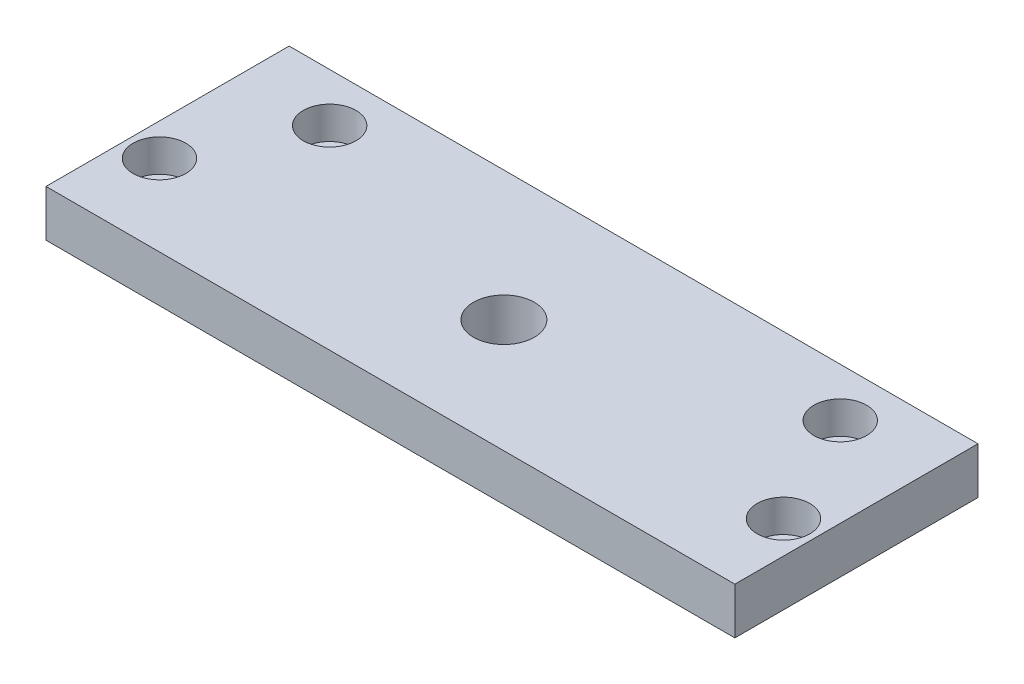
ISO-10303-21;
HEADER;
FILE_DESCRIPTION(('STEP AP214'),'2;1');
FILE_NAME('part.step','',(''),(''),'','','');
FILE_SCHEMA(('AUTOMOTIVE_DESIGN { 1 0 10303 214 1 1 1 1 }'));
ENDSEC;
DATA;
#1=APPLICATION_CONTEXT('core data for automotive mechanical design processes');
#2=APPLICATION_PROTOCOL_DEFINITION('international standard','automotive_design',2000,#1);
#3=PRODUCT_CONTEXT('',#1,'mechanical');
#4=PRODUCT('Part','Part','',(#3));
#5=PRODUCT_RELATED_PRODUCT_CATEGORY('part','',(#4));
#6=PRODUCT_DEFINITION_FORMATION('','',#4);
#7=PRODUCT_DEFINITION_CONTEXT('part definition',#1,'design');
#8=PRODUCT_DEFINITION('design','',#6,#7);
#9=PRODUCT_DEFINITION_SHAPE('','',#8);
#10=(LENGTH_UNIT() NAMED_UNIT(*) SI_UNIT(.MILLI.,.METRE.));
#11=(NAMED_UNIT(*) PLANE_ANGLE_UNIT() SI_UNIT($,.RADIAN.));
#12=(NAMED_UNIT(*) SI_UNIT($,.STERADIAN.) SOLID_ANGLE_UNIT());
#13=UNCERTAINTY_MEASURE_WITH_UNIT(LENGTH_MEASURE(1.E-05),#10,'distance_accuracy_value','');
#14=(GEOMETRIC_REPRESENTATION_CONTEXT(3) GLOBAL_UNCERTAINTY_ASSIGNED_CONTEXT((#13)) GLOBAL_UNIT_ASSIGNED_CONTEXT((#10,
#11,#12)) REPRESENTATION_CONTEXT('',''));
#15=CARTESIAN_POINT('',(0.,0.,0.));
#16=DIRECTION('',(0.,0.,1.));
#17=DIRECTION('',(1.,0.,0.));
#18=AXIS2_PLACEMENT_3D('',#15,#16,#17);
#19=CARTESIAN_POINT('',(-63.,3.5,-20.));
#20=DIRECTION('',(0.,1.,0.));
#21=DIRECTION('',(0.,0.,1.));
#22=AXIS2_PLACEMENT_3D('',#19,#20,#21);
#23=CYLINDRICAL_SURFACE('',#22,6.5);
#24=CARTESIAN_POINT('',(-63.,3.5,-20.));
#25=DIRECTION('',(0.,1.,0.));
#26=DIRECTION('',(0.,0.,1.));
#27=AXIS2_PLACEMENT_3D('',#24,#25,#26);
#28=CIRCLE('',#27,6.5);
#29=CARTESIAN_POINT('',(-63.,3.5,-13.5));
#30=VERTEX_POINT('',#29);
#31=EDGE_CURVE('E130',#30,#30,#28,.T.);
#32=ORIENTED_EDGE('',*,*,#31,.F.);
#33=EDGE_LOOP('',(#32));
#34=FACE_BOUND('',#33,.T.);
#35=CARTESIAN_POINT('',(-63.,11.5,-20.));
#36=DIRECTION('',(0.,1.,0.));
#37=DIRECTION('',(0.,0.,1.));
#38=AXIS2_PLACEMENT_3D('',#35,#36,#37);
#39=CIRCLE('',#38,6.5);
#40=CARTESIAN_POINT('',(-63.,11.5,-13.5));
#41=VERTEX_POINT('',#40);
#42=EDGE_CURVE('E124',#41,#41,#39,.T.);
#43=ORIENTED_EDGE('',*,*,#42,.T.);
#44=EDGE_LOOP('',(#43));
#45=FACE_BOUND('',#44,.T.);
#46=ADVANCED_FACE('F17',(#34,#45),#23,.F.);
#47=CARTESIAN_POINT('',(-77.,3.5,8.));
#48=DIRECTION('',(0.,1.,0.));
#49=DIRECTION('',(0.,0.,1.));
#50=AXIS2_PLACEMENT_3D('',#47,#48,#49);
#51=CYLINDRICAL_SURFACE('',#50,6.5);
#52=CARTESIAN_POINT('',(-77.,3.5,8.));
#53=DIRECTION('',(0.,1.,0.));
#54=DIRECTION('',(0.,0.,1.));
#55=AXIS2_PLACEMENT_3D('',#52,#53,#54);
#56=CIRCLE('',#55,6.5);
#57=CARTESIAN_POINT('',(-77.,3.5,14.5));
#58=VERTEX_POINT('',#57);
#59=EDGE_CURVE('E132',#58,#58,#56,.T.);
#60=ORIENTED_EDGE('',*,*,#59,.F.);
#61=EDGE_LOOP('',(#60));
#62=FACE_BOUND('',#61,.T.);
#63=CARTESIAN_POINT('',(-77.,11.5,8.));
#64=DIRECTION('',(0.,1.,0.));
#65=DIRECTION('',(0.,0.,1.));
#66=AXIS2_PLACEMENT_3D('',#63,#64,#65);
#67=CIRCLE('',#66,6.5);
#68=CARTESIAN_POINT('',(-77.,11.5,14.5));
#69=VERTEX_POINT('',#68);
#70=EDGE_CURVE('E121',#69,#69,#67,.T.);
#71=ORIENTED_EDGE('',*,*,#70,.T.);
#72=EDGE_LOOP('',(#71));
#73=FACE_BOUND('',#72,.T.);
#74=ADVANCED_FACE('F203',(#62,#73),#51,.F.);
#75=CARTESIAN_POINT('',(63.,3.5,-20.));
#76=DIRECTION('',(0.,1.,0.));
#77=DIRECTION('',(0.,0.,1.));
#78=AXIS2_PLACEMENT_3D('',#75,#76,#77);
#79=CYLINDRICAL_SURFACE('',#78,6.5);
#80=CARTESIAN_POINT('',(63.,3.5,-20.));
#81=DIRECTION('',(0.,1.,0.));
#82=DIRECTION('',(0.,0.,1.));
#83=AXIS2_PLACEMENT_3D('',#80,#81,#82);
#84=CIRCLE('',#83,6.5);
#85=CARTESIAN_POINT('',(63.,3.5,-13.5));
#86=VERTEX_POINT('',#85);
#87=EDGE_CURVE('E127',#86,#86,#84,.T.);
#88=ORIENTED_EDGE('',*,*,#87,.F.);
#89=EDGE_LOOP('',(#88));
#90=FACE_BOUND('',#89,.T.);
#91=CARTESIAN_POINT('',(63.,11.5,-20.));
#92=DIRECTION('',(0.,1.,0.));
#93=DIRECTION('',(0.,0.,1.));
#94=AXIS2_PLACEMENT_3D('',#91,#92,#93);
#95=CIRCLE('',#94,6.5);
#96=CARTESIAN_POINT('',(63.,11.5,-13.5));
#97=VERTEX_POINT('',#96);
#98=EDGE_CURVE('E118',#97,#97,#95,.T.);
#99=ORIENTED_EDGE('',*,*,#98,.T.);
#100=EDGE_LOOP('',(#99));
#101=FACE_BOUND('',#100,.T.);
#102=ADVANCED_FACE('F145',(#90,#101),#79,.F.);
#103=CARTESIAN_POINT('',(77.,3.5,8.));
#104=DIRECTION('',(0.,1.,0.));
#105=DIRECTION('',(0.,0.,1.));
#106=AXIS2_PLACEMENT_3D('',#103,#104,#105);
#107=CYLINDRICAL_SURFACE('',#106,6.5);
#108=CARTESIAN_POINT('',(77.,3.5,8.));
#109=DIRECTION('',(0.,1.,0.));
#110=DIRECTION('',(0.,0.,1.));
#111=AXIS2_PLACEMENT_3D('',#108,#109,#110);
#112=CIRCLE('',#111,6.5);
#113=CARTESIAN_POINT('',(77.,3.5,14.5));
#114=VERTEX_POINT('',#113);
#115=EDGE_CURVE('E20',#114,#114,#112,.T.);
#116=ORIENTED_EDGE('',*,*,#115,.F.);
#117=EDGE_LOOP('',(#116));
#118=FACE_BOUND('',#117,.T.);
#119=CARTESIAN_POINT('',(77.,11.5,8.));
#120=DIRECTION('',(0.,1.,0.));
#121=DIRECTION('',(0.,0.,1.));
#122=AXIS2_PLACEMENT_3D('',#119,#120,#121);
#123=CIRCLE('',#122,6.5);
#124=CARTESIAN_POINT('',(77.,11.5,14.5));
#125=VERTEX_POINT('',#124);
#126=EDGE_CURVE('E115',#125,#125,#123,.T.);
#127=ORIENTED_EDGE('',*,*,#126,.T.);
#128=EDGE_LOOP('',(#127));
#129=FACE_BOUND('',#128,.T.);
#130=ADVANCED_FACE('F142',(#118,#129),#107,.F.);
#131=CARTESIAN_POINT('',(77.,3.5,8.));
#132=DIRECTION('',(0.,1.,0.));
#133=DIRECTION('',(0.,0.,1.));
#134=AXIS2_PLACEMENT_3D('',#131,#132,#133);
#135=PLANE('',#134);
#136=ORIENTED_EDGE('',*,*,#115,.T.);
#137=EDGE_LOOP('',(#136));
#138=FACE_BOUND('',#137,.T.);
#139=CARTESIAN_POINT('',(77.,3.5,8.));
#140=DIRECTION('',(0.,-1.,0.));
#141=DIRECTION('',(0.,0.,-1.));
#142=AXIS2_PLACEMENT_3D('',#139,#140,#141);
#143=CIRCLE('',#142,4.25);
#144=CARTESIAN_POINT('',(77.,3.5,3.75));
#145=VERTEX_POINT('',#144);
#146=EDGE_CURVE('E112',#145,#145,#143,.T.);
#147=ORIENTED_EDGE('',*,*,#146,.T.);
#148=EDGE_LOOP('',(#147));
#149=FACE_BOUND('',#148,.T.);
#150=ADVANCED_FACE('F139',(#138,#149),#135,.T.);
#151=CARTESIAN_POINT('',(-77.,3.5,8.));
#152=DIRECTION('',(0.,1.,0.));
#153=DIRECTION('',(0.,0.,1.));
#154=AXIS2_PLACEMENT_3D('',#151,#152,#153);
#155=PLANE('',#154);
#156=ORIENTED_EDGE('',*,*,#59,.T.);
#157=EDGE_LOOP('',(#156));
#158=FACE_BOUND('',#157,.T.);
#159=CARTESIAN_POINT('',(-77.,3.5,8.));
#160=DIRECTION('',(0.,-1.,0.));
#161=DIRECTION('',(0.,0.,-1.));
#162=AXIS2_PLACEMENT_3D('',#159,#160,#161);
#163=CIRCLE('',#162,4.25);
#164=CARTESIAN_POINT('',(-77.,3.5,3.75));
#165=VERTEX_POINT('',#164);
#166=EDGE_CURVE('E109',#165,#165,#163,.T.);
#167=ORIENTED_EDGE('',*,*,#166,.T.);
#168=EDGE_LOOP('',(#167));
#169=FACE_BOUND('',#168,.T.);
#170=ADVANCED_FACE('F196',(#158,#169),#155,.T.);
#171=CARTESIAN_POINT('',(-63.,3.5,-20.));
#172=DIRECTION('',(0.,1.,0.));
#173=DIRECTION('',(0.,0.,1.));
#174=AXIS2_PLACEMENT_3D('',#171,#172,#173);
#175=PLANE('',#174);
#176=ORIENTED_EDGE('',*,*,#31,.T.);
#177=EDGE_LOOP('',(#176));
#178=FACE_BOUND('',#177,.T.);
#179=CARTESIAN_POINT('',(-63.,3.5,-20.));
#180=DIRECTION('',(0.,-1.,0.));
#181=DIRECTION('',(0.,0.,-1.));
#182=AXIS2_PLACEMENT_3D('',#179,#180,#181);
#183=CIRCLE('',#182,4.25);
#184=CARTESIAN_POINT('',(-63.,3.5,-24.25));
#185=VERTEX_POINT('',#184);
#186=EDGE_CURVE('E103',#185,#185,#183,.T.);
#187=ORIENTED_EDGE('',*,*,#186,.T.);
#188=EDGE_LOOP('',(#187));
#189=FACE_BOUND('',#188,.T.);
#190=ADVANCED_FACE('F192',(#178,#189),#175,.T.);
#191=CARTESIAN_POINT('',(63.,3.5,-20.));
#192=DIRECTION('',(0.,1.,0.));
#193=DIRECTION('',(0.,0.,1.));
#194=AXIS2_PLACEMENT_3D('',#191,#192,#193);
#195=PLANE('',#194);
#196=ORIENTED_EDGE('',*,*,#87,.T.);
#197=EDGE_LOOP('',(#196));
#198=FACE_BOUND('',#197,.T.);
#199=CARTESIAN_POINT('',(63.,3.5,-20.));
#200=DIRECTION('',(0.,-1.,0.));
#201=DIRECTION('',(0.,0.,-1.));
#202=AXIS2_PLACEMENT_3D('',#199,#200,#201);
#203=CIRCLE('',#202,4.25);
#204=CARTESIAN_POINT('',(63.,3.5,-24.25));
#205=VERTEX_POINT('',#204);
#206=EDGE_CURVE('E69',#205,#205,#203,.T.);
#207=ORIENTED_EDGE('',*,*,#206,.T.);
#208=EDGE_LOOP('',(#207));
#209=FACE_BOUND('',#208,.T.);
#210=ADVANCED_FACE('F151',(#198,#209),#195,.T.);
#211=CARTESIAN_POINT('',(-85.,11.5,-32.));
#212=DIRECTION('',(0.,-1.,0.));
#213=DIRECTION('',(0.,0.,-1.));
#214=AXIS2_PLACEMENT_3D('',#211,#212,#213);
#215=PLANE('',#214);
#216=DIRECTION('',(1.,0.,0.));
#217=VECTOR('',#216,1.);
#218=CARTESIAN_POINT('',(-85.,11.5,-32.));
#219=LINE('',#218,#217);
#220=CARTESIAN_POINT('',(85.,11.5,-32.));
#221=VERTEX_POINT('',#220);
#222=CARTESIAN_POINT('',(-85.,11.5,-32.));
#223=VERTEX_POINT('',#222);
#224=EDGE_CURVE('E73',#221,#223,#219,.F.);
#225=ORIENTED_EDGE('',*,*,#224,.T.);
#226=DIRECTION('',(0.,0.,-1.));
#227=VECTOR('',#226,1.);
#228=CARTESIAN_POINT('',(-85.,11.5,28.));
#229=LINE('',#228,#227);
#230=CARTESIAN_POINT('',(-85.,11.5,28.));
#231=VERTEX_POINT('',#230);
#232=EDGE_CURVE('E55',#223,#231,#229,.F.);
#233=ORIENTED_EDGE('',*,*,#232,.T.);
#234=DIRECTION('',(-1.,0.,0.));
#235=VECTOR('',#234,1.);
#236=CARTESIAN_POINT('',(85.,11.5,28.));
#237=LINE('',#236,#235);
#238=CARTESIAN_POINT('',(85.,11.5,28.));
#239=VERTEX_POINT('',#238);
#240=EDGE_CURVE('E60',#231,#239,#237,.F.);
#241=ORIENTED_EDGE('',*,*,#240,.T.);
#242=DIRECTION('',(0.,0.,1.));
#243=VECTOR('',#242,1.);
#244=CARTESIAN_POINT('',(85.,11.5,-32.));
#245=LINE('',#244,#243);
#246=EDGE_CURVE('E100',#239,#221,#245,.F.);
#247=ORIENTED_EDGE('',*,*,#246,.T.);
#248=EDGE_LOOP('',(#225,#233,#241,#247));
#249=FACE_BOUND('',#248,.T.);
#250=ORIENTED_EDGE('',*,*,#126,.F.);
#251=EDGE_LOOP('',(#250));
#252=FACE_BOUND('',#251,.T.);
#253=ORIENTED_EDGE('',*,*,#98,.F.);
#254=EDGE_LOOP('',(#253));
#255=FACE_BOUND('',#254,.T.);
#256=ORIENTED_EDGE('',*,*,#70,.F.);
#257=EDGE_LOOP('',(#256));
#258=FACE_BOUND('',#257,.T.);
#259=ORIENTED_EDGE('',*,*,#42,.F.);
#260=EDGE_LOOP('',(#259));
#261=FACE_BOUND('',#260,.T.);
#262=CARTESIAN_POINT('',(0.,11.5,0.));
#263=DIRECTION('',(0.,-1.,0.));
#264=DIRECTION('',(0.,0.,-1.));
#265=AXIS2_PLACEMENT_3D('',#262,#263,#264);
#266=CIRCLE('',#265,7.5);
#267=CARTESIAN_POINT('',(0.,11.5,-7.5));
#268=VERTEX_POINT('',#267);
#269=EDGE_CURVE('E106',#268,#268,#266,.T.);
#270=ORIENTED_EDGE('',*,*,#269,.T.);
#271=EDGE_LOOP('',(#270));
#272=FACE_BOUND('',#271,.T.);
#273=ADVANCED_FACE('F71',(#249,#252,#255,#258,#261,#272),#215,.F.);
#274=CARTESIAN_POINT('',(77.,11.5,8.));
#275=DIRECTION('',(0.,-1.,0.));
#276=DIRECTION('',(0.,0.,-1.));
#277=AXIS2_PLACEMENT_3D('',#274,#275,#276);
#278=CYLINDRICAL_SURFACE('',#277,4.25);
#279=ORIENTED_EDGE('',*,*,#146,.F.);
#280=EDGE_LOOP('',(#279));
#281=FACE_BOUND('',#280,.T.);
#282=CARTESIAN_POINT('',(77.,0.,8.));
#283=DIRECTION('',(0.,-1.,0.));
#284=DIRECTION('',(0.,0.,-1.));
#285=AXIS2_PLACEMENT_3D('',#282,#283,#284);
#286=CIRCLE('',#285,4.25);
#287=CARTESIAN_POINT('',(77.,0.,3.75));
#288=VERTEX_POINT('',#287);
#289=EDGE_CURVE('E97',#288,#288,#286,.F.);
#290=ORIENTED_EDGE('',*,*,#289,.F.);
#291=EDGE_LOOP('',(#290));
#292=FACE_BOUND('',#291,.T.);
#293=ADVANCED_FACE('F150',(#281,#292),#278,.F.);
#294=CARTESIAN_POINT('',(-77.,11.5,8.));
#295=DIRECTION('',(0.,-1.,0.));
#296=DIRECTION('',(0.,0.,-1.));
#297=AXIS2_PLACEMENT_3D('',#294,#295,#296);
#298=CYLINDRICAL_SURFACE('',#297,4.25);
#299=ORIENTED_EDGE('',*,*,#166,.F.);
#300=EDGE_LOOP('',(#299));
#301=FACE_BOUND('',#300,.T.);
#302=CARTESIAN_POINT('',(-77.,0.,8.));
#303=DIRECTION('',(0.,-1.,0.));
#304=DIRECTION('',(0.,0.,-1.));
#305=AXIS2_PLACEMENT_3D('',#302,#303,#304);
#306=CIRCLE('',#305,4.25);
#307=CARTESIAN_POINT('',(-77.,0.,3.75));
#308=VERTEX_POINT('',#307);
#309=EDGE_CURVE('E94',#308,#308,#306,.F.);
#310=ORIENTED_EDGE('',*,*,#309,.F.);
#311=EDGE_LOOP('',(#310));
#312=FACE_BOUND('',#311,.T.);
#313=ADVANCED_FACE('F165',(#301,#312),#298,.F.);
#314=CARTESIAN_POINT('',(0.,11.5,0.));
#315=DIRECTION('',(0.,-1.,0.));
#316=DIRECTION('',(0.,0.,-1.));
#317=AXIS2_PLACEMENT_3D('',#314,#315,#316);
#318=CYLINDRICAL_SURFACE('',#317,7.5);
#319=ORIENTED_EDGE('',*,*,#269,.F.);
#320=EDGE_LOOP('',(#319));
#321=FACE_BOUND('',#320,.T.);
#322=CARTESIAN_POINT('',(0.,0.,0.));
#323=DIRECTION('',(0.,-1.,0.));
#324=DIRECTION('',(0.,0.,-1.));
#325=AXIS2_PLACEMENT_3D('',#322,#323,#324);
#326=CIRCLE('',#325,7.5);
#327=CARTESIAN_POINT('',(0.,0.,-7.5));
#328=VERTEX_POINT('',#327);
#329=EDGE_CURVE('E91',#328,#328,#326,.F.);
#330=ORIENTED_EDGE('',*,*,#329,.F.);
#331=EDGE_LOOP('',(#330));
#332=FACE_BOUND('',#331,.T.);
#333=ADVANCED_FACE('F161',(#321,#332),#318,.F.);
#334=CARTESIAN_POINT('',(-63.,11.5,-20.));
#335=DIRECTION('',(0.,-1.,0.));
#336=DIRECTION('',(0.,0.,-1.));
#337=AXIS2_PLACEMENT_3D('',#334,#335,#336);
#338=CYLINDRICAL_SURFACE('',#337,4.25);
#339=ORIENTED_EDGE('',*,*,#186,.F.);
#340=EDGE_LOOP('',(#339));
#341=FACE_BOUND('',#340,.T.);
#342=CARTESIAN_POINT('',(-63.,0.,-20.));
#343=DIRECTION('',(0.,-1.,0.));
#344=DIRECTION('',(0.,0.,-1.));
#345=AXIS2_PLACEMENT_3D('',#342,#343,#344);
#346=CIRCLE('',#345,4.25);
#347=CARTESIAN_POINT('',(-63.,0.,-24.25));
#348=VERTEX_POINT('',#347);
#349=EDGE_CURVE('E88',#348,#348,#346,.F.);
#350=ORIENTED_EDGE('',*,*,#349,.F.);
#351=EDGE_LOOP('',(#350));
#352=FACE_BOUND('',#351,.T.);
#353=ADVANCED_FACE('F164',(#341,#352),#338,.F.);
#354=CARTESIAN_POINT('',(63.,11.5,-20.));
#355=DIRECTION('',(0.,-1.,0.));
#356=DIRECTION('',(0.,0.,-1.));
#357=AXIS2_PLACEMENT_3D('',#354,#355,#356);
#358=CYLINDRICAL_SURFACE('',#357,4.25);
#359=ORIENTED_EDGE('',*,*,#206,.F.);
#360=EDGE_LOOP('',(#359));
#361=FACE_BOUND('',#360,.T.);
#362=CARTESIAN_POINT('',(63.,0.,-20.));
#363=DIRECTION('',(0.,-1.,0.));
#364=DIRECTION('',(0.,0.,-1.));
#365=AXIS2_PLACEMENT_3D('',#362,#363,#364);
#366=CIRCLE('',#365,4.25);
#367=CARTESIAN_POINT('',(63.,0.,-24.25));
#368=VERTEX_POINT('',#367);
#369=EDGE_CURVE('E84',#368,#368,#366,.F.);
#370=ORIENTED_EDGE('',*,*,#369,.F.);
#371=EDGE_LOOP('',(#370));
#372=FACE_BOUND('',#371,.T.);
#373=ADVANCED_FACE('F221',(#361,#372),#358,.F.);
#374=CARTESIAN_POINT('',(85.,11.5,28.));
#375=DIRECTION('',(0.,0.,-1.));
#376=DIRECTION('',(-1.,0.,0.));
#377=AXIS2_PLACEMENT_3D('',#374,#375,#376);
#378=PLANE('',#377);
#379=DIRECTION('',(0.,1.,0.));
#380=VECTOR('',#379,1.);
#381=CARTESIAN_POINT('',(-85.,11.5,28.));
#382=LINE('',#381,#380);
#383=CARTESIAN_POINT('',(-85.,0.,28.));
#384=VERTEX_POINT('',#383);
#385=EDGE_CURVE('E62',#231,#384,#382,.F.);
#386=ORIENTED_EDGE('',*,*,#385,.T.);
#387=DIRECTION('',(1.,0.,0.));
#388=VECTOR('',#387,1.);
#389=CARTESIAN_POINT('',(-85.,0.,28.));
#390=LINE('',#389,#388);
#391=CARTESIAN_POINT('',(85.,0.,28.));
#392=VERTEX_POINT('',#391);
#393=EDGE_CURVE('E87',#392,#384,#390,.F.);
#394=ORIENTED_EDGE('',*,*,#393,.F.);
#395=DIRECTION('',(0.,1.,0.));
#396=VECTOR('',#395,1.);
#397=CARTESIAN_POINT('',(85.,11.5,28.));
#398=LINE('',#397,#396);
#399=EDGE_CURVE('E65',#392,#239,#398,.T.);
#400=ORIENTED_EDGE('',*,*,#399,.T.);
#401=ORIENTED_EDGE('',*,*,#240,.F.);
#402=EDGE_LOOP('',(#386,#394,#400,#401));
#403=FACE_BOUND('',#402,.T.);
#404=ADVANCED_FACE('F61',(#403),#378,.F.);
#405=CARTESIAN_POINT('',(-85.,11.5,28.));
#406=DIRECTION('',(1.,0.,0.));
#407=DIRECTION('',(0.,0.,-1.));
#408=AXIS2_PLACEMENT_3D('',#405,#406,#407);
#409=PLANE('',#408);
#410=DIRECTION('',(0.,1.,0.));
#411=VECTOR('',#410,1.);
#412=CARTESIAN_POINT('',(-85.,11.5,-32.));
#413=LINE('',#412,#411);
#414=CARTESIAN_POINT('',(-85.,0.,-32.));
#415=VERTEX_POINT('',#414);
#416=EDGE_CURVE('E75',#223,#415,#413,.F.);
#417=ORIENTED_EDGE('',*,*,#416,.T.);
#418=DIRECTION('',(0.,0.,-1.));
#419=VECTOR('',#418,1.);
#420=CARTESIAN_POINT('',(-85.,0.,-32.));
#421=LINE('',#420,#419);
#422=EDGE_CURVE('E79',#384,#415,#421,.T.);
#423=ORIENTED_EDGE('',*,*,#422,.F.);
#424=ORIENTED_EDGE('',*,*,#385,.F.);
#425=ORIENTED_EDGE('',*,*,#232,.F.);
#426=EDGE_LOOP('',(#417,#423,#424,#425));
#427=FACE_BOUND('',#426,.T.);
#428=ADVANCED_FACE('F77',(#427),#409,.F.);
#429=CARTESIAN_POINT('',(-85.,11.5,-32.));
#430=DIRECTION('',(0.,0.,1.));
#431=DIRECTION('',(1.,0.,0.));
#432=AXIS2_PLACEMENT_3D('',#429,#430,#431);
#433=PLANE('',#432);
#434=DIRECTION('',(0.,1.,0.));
#435=VECTOR('',#434,1.);
#436=CARTESIAN_POINT('',(85.,11.5,-32.));
#437=LINE('',#436,#435);
#438=CARTESIAN_POINT('',(85.,0.,-32.));
#439=VERTEX_POINT('',#438);
#440=EDGE_CURVE('E35',#221,#439,#437,.F.);
#441=ORIENTED_EDGE('',*,*,#440,.T.);
#442=DIRECTION('',(1.,0.,0.));
#443=VECTOR('',#442,1.);
#444=CARTESIAN_POINT('',(-85.,0.,-32.));
#445=LINE('',#444,#443);
#446=EDGE_CURVE('E26',#415,#439,#445,.T.);
#447=ORIENTED_EDGE('',*,*,#446,.F.);
#448=ORIENTED_EDGE('',*,*,#416,.F.);
#449=ORIENTED_EDGE('',*,*,#224,.F.);
#450=EDGE_LOOP('',(#441,#447,#448,#449));
#451=FACE_BOUND('',#450,.T.);
#452=ADVANCED_FACE('F235',(#451),#433,.F.);
#453=CARTESIAN_POINT('',(85.,11.5,-32.));
#454=DIRECTION('',(-1.,0.,0.));
#455=DIRECTION('',(0.,0.,1.));
#456=AXIS2_PLACEMENT_3D('',#453,#454,#455);
#457=PLANE('',#456);
#458=ORIENTED_EDGE('',*,*,#399,.F.);
#459=DIRECTION('',(0.,0.,-1.));
#460=VECTOR('',#459,1.);
#461=CARTESIAN_POINT('',(85.,0.,-32.));
#462=LINE('',#461,#460);
#463=EDGE_CURVE('E11',#439,#392,#462,.F.);
#464=ORIENTED_EDGE('',*,*,#463,.F.);
#465=ORIENTED_EDGE('',*,*,#440,.F.);
#466=ORIENTED_EDGE('',*,*,#246,.F.);
#467=EDGE_LOOP('',(#458,#464,#465,#466));
#468=FACE_BOUND('',#467,.T.);
#469=ADVANCED_FACE('F172',(#468),#457,.F.);
#470=CARTESIAN_POINT('',(-85.,0.,-32.));
#471=DIRECTION('',(0.,-1.,0.));
#472=DIRECTION('',(0.,0.,-1.));
#473=AXIS2_PLACEMENT_3D('',#470,#471,#472);
#474=PLANE('',#473);
#475=ORIENTED_EDGE('',*,*,#446,.T.);
#476=ORIENTED_EDGE('',*,*,#463,.T.);
#477=ORIENTED_EDGE('',*,*,#393,.T.);
#478=ORIENTED_EDGE('',*,*,#422,.T.);
#479=EDGE_LOOP('',(#475,#476,#477,#478));
#480=FACE_BOUND('',#479,.T.);
#481=ORIENTED_EDGE('',*,*,#369,.T.);
#482=EDGE_LOOP('',(#481));
#483=FACE_BOUND('',#482,.T.);
#484=ORIENTED_EDGE('',*,*,#349,.T.);
#485=EDGE_LOOP('',(#484));
#486=FACE_BOUND('',#485,.T.);
#487=ORIENTED_EDGE('',*,*,#329,.T.);
#488=EDGE_LOOP('',(#487));
#489=FACE_BOUND('',#488,.T.);
#490=ORIENTED_EDGE('',*,*,#309,.T.);
#491=EDGE_LOOP('',(#490));
#492=FACE_BOUND('',#491,.T.);
#493=ORIENTED_EDGE('',*,*,#289,.T.);
#494=EDGE_LOOP('',(#493));
#495=FACE_BOUND('',#494,.T.);
#496=ADVANCED_FACE('F169',(#480,#483,#486,#489,#492,#495),#474,.T.);
#497=CLOSED_SHELL('',(#46,#74,#102,#130,#150,#170,#190,#210,#273,#293,#313,#333,#353,#373,#404,
#428,#452,#469,#496));
#498=MANIFOLD_SOLID_BREP('B1',#497);
#499=ADVANCED_BREP_SHAPE_REPRESENTATION('',(#18,#498),#14);
#500=SHAPE_DEFINITION_REPRESENTATION(#9,#499);
ENDSEC;
END-ISO-10303-21;
